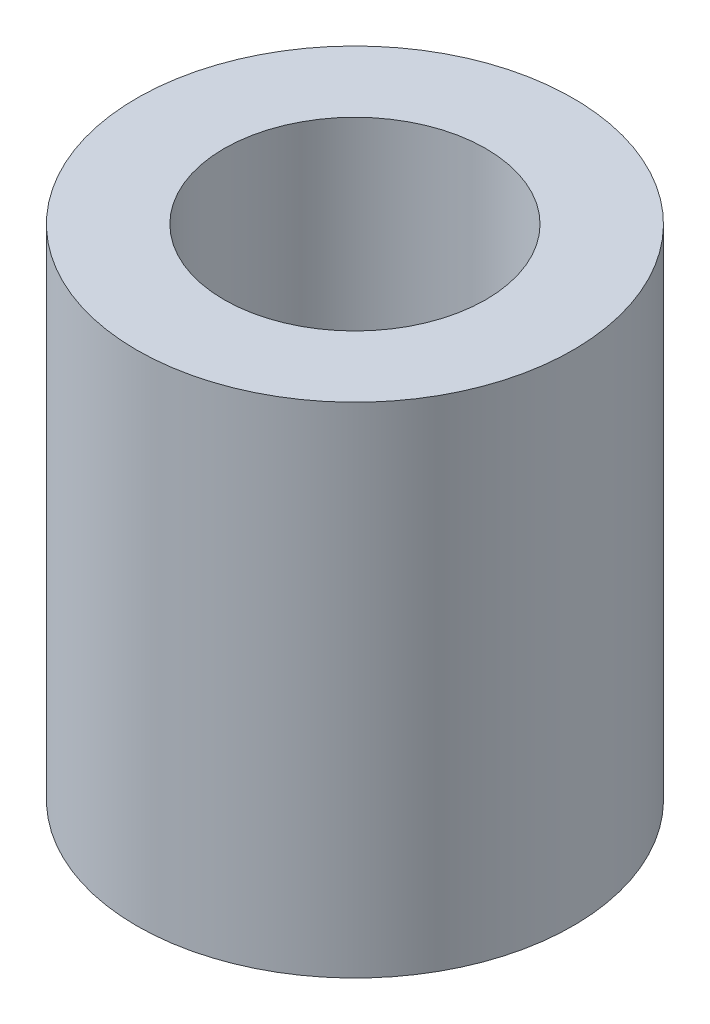
ISO-10303-21;
HEADER;
FILE_DESCRIPTION(('STEP AP214'),'2;1');
FILE_NAME('part.step','',(''),(''),'','','');
FILE_SCHEMA(('AUTOMOTIVE_DESIGN { 1 0 10303 214 1 1 1 1 }'));
ENDSEC;
DATA;
#1=APPLICATION_CONTEXT('core data for automotive mechanical design processes');
#2=APPLICATION_PROTOCOL_DEFINITION('international standard','automotive_design',2000,#1);
#3=PRODUCT_CONTEXT('',#1,'mechanical');
#4=PRODUCT('Part','Part','',(#3));
#5=PRODUCT_RELATED_PRODUCT_CATEGORY('part','',(#4));
#6=PRODUCT_DEFINITION_FORMATION('','',#4);
#7=PRODUCT_DEFINITION_CONTEXT('part definition',#1,'design');
#8=PRODUCT_DEFINITION('design','',#6,#7);
#9=PRODUCT_DEFINITION_SHAPE('','',#8);
#10=(LENGTH_UNIT() NAMED_UNIT(*) SI_UNIT(.MILLI.,.METRE.));
#11=(NAMED_UNIT(*) PLANE_ANGLE_UNIT() SI_UNIT($,.RADIAN.));
#12=(NAMED_UNIT(*) SI_UNIT($,.STERADIAN.) SOLID_ANGLE_UNIT());
#13=UNCERTAINTY_MEASURE_WITH_UNIT(LENGTH_MEASURE(1.E-05),#10,'distance_accuracy_value','');
#14=(GEOMETRIC_REPRESENTATION_CONTEXT(3) GLOBAL_UNCERTAINTY_ASSIGNED_CONTEXT((#13)) GLOBAL_UNIT_ASSIGNED_CONTEXT((#10,
#11,#12)) REPRESENTATION_CONTEXT('',''));
#15=CARTESIAN_POINT('',(0.,0.,0.));
#16=DIRECTION('',(0.,0.,1.));
#17=DIRECTION('',(1.,0.,0.));
#18=AXIS2_PLACEMENT_3D('',#15,#16,#17);
#19=CARTESIAN_POINT('',(0.,8.,0.));
#20=DIRECTION('',(0.,1.,0.));
#21=DIRECTION('',(0.,0.,1.));
#22=AXIS2_PLACEMENT_3D('',#19,#20,#21);
#23=PLANE('',#22);
#24=CARTESIAN_POINT('',(0.,8.,0.));
#25=DIRECTION('',(0.,1.,0.));
#26=DIRECTION('',(0.,0.,1.));
#27=AXIS2_PLACEMENT_3D('',#24,#25,#26);
#28=CIRCLE('',#27,3.5);
#29=CARTESIAN_POINT('',(0.,8.,3.5));
#30=VERTEX_POINT('',#29);
#31=EDGE_CURVE('E10',#30,#30,#28,.T.);
#32=ORIENTED_EDGE('',*,*,#31,.T.);
#33=EDGE_LOOP('',(#32));
#34=FACE_BOUND('',#33,.T.);
#35=CARTESIAN_POINT('',(0.,8.,0.));
#36=DIRECTION('',(0.,1.,0.));
#37=DIRECTION('',(0.,0.,1.));
#38=AXIS2_PLACEMENT_3D('',#35,#36,#37);
#39=CIRCLE('',#38,2.1);
#40=CARTESIAN_POINT('',(0.,8.,2.1));
#41=VERTEX_POINT('',#40);
#42=EDGE_CURVE('E44',#41,#41,#39,.T.);
#43=ORIENTED_EDGE('',*,*,#42,.F.);
#44=EDGE_LOOP('',(#43));
#45=FACE_BOUND('',#44,.T.);
#46=ADVANCED_FACE('F33',(#34,#45),#23,.T.);
#47=CARTESIAN_POINT('',(0.,0.,0.));
#48=DIRECTION('',(0.,1.,0.));
#49=DIRECTION('',(0.,0.,1.));
#50=AXIS2_PLACEMENT_3D('',#47,#48,#49);
#51=PLANE('',#50);
#52=CARTESIAN_POINT('',(0.,0.,0.));
#53=DIRECTION('',(0.,1.,0.));
#54=DIRECTION('',(0.,0.,1.));
#55=AXIS2_PLACEMENT_3D('',#52,#53,#54);
#56=CIRCLE('',#55,3.5);
#57=CARTESIAN_POINT('',(0.,0.,3.5));
#58=VERTEX_POINT('',#57);
#59=EDGE_CURVE('E37',#58,#58,#56,.T.);
#60=ORIENTED_EDGE('',*,*,#59,.F.);
#61=EDGE_LOOP('',(#60));
#62=FACE_BOUND('',#61,.T.);
#63=CARTESIAN_POINT('',(0.,0.,0.));
#64=DIRECTION('',(0.,1.,0.));
#65=DIRECTION('',(0.,0.,1.));
#66=AXIS2_PLACEMENT_3D('',#63,#64,#65);
#67=CIRCLE('',#66,2.1);
#68=CARTESIAN_POINT('',(0.,0.,2.1));
#69=VERTEX_POINT('',#68);
#70=EDGE_CURVE('E46',#69,#69,#67,.T.);
#71=ORIENTED_EDGE('',*,*,#70,.T.);
#72=EDGE_LOOP('',(#71));
#73=FACE_BOUND('',#72,.T.);
#74=ADVANCED_FACE('F56',(#62,#73),#51,.F.);
#75=CARTESIAN_POINT('',(0.,8.,0.));
#76=DIRECTION('',(0.,-1.,0.));
#77=DIRECTION('',(0.,0.,-1.));
#78=AXIS2_PLACEMENT_3D('',#75,#76,#77);
#79=CYLINDRICAL_SURFACE('',#78,3.5);
#80=ORIENTED_EDGE('',*,*,#31,.F.);
#81=EDGE_LOOP('',(#80));
#82=FACE_BOUND('',#81,.T.);
#83=ORIENTED_EDGE('',*,*,#59,.T.);
#84=EDGE_LOOP('',(#83));
#85=FACE_BOUND('',#84,.T.);
#86=ADVANCED_FACE('F35',(#82,#85),#79,.T.);
#87=CARTESIAN_POINT('',(0.,8.,0.));
#88=DIRECTION('',(0.,-1.,0.));
#89=DIRECTION('',(0.,0.,-1.));
#90=AXIS2_PLACEMENT_3D('',#87,#88,#89);
#91=CYLINDRICAL_SURFACE('',#90,2.1);
#92=ORIENTED_EDGE('',*,*,#42,.T.);
#93=EDGE_LOOP('',(#92));
#94=FACE_BOUND('',#93,.T.);
#95=ORIENTED_EDGE('',*,*,#70,.F.);
#96=EDGE_LOOP('',(#95));
#97=FACE_BOUND('',#96,.T.);
#98=ADVANCED_FACE('F52',(#94,#97),#91,.F.);
#99=CLOSED_SHELL('',(#46,#74,#86,#98));
#100=MANIFOLD_SOLID_BREP('B2',#99);
#101=ADVANCED_BREP_SHAPE_REPRESENTATION('',(#18,#100),#14);
#102=SHAPE_DEFINITION_REPRESENTATION(#9,#101);
ENDSEC;
END-ISO-10303-21;
